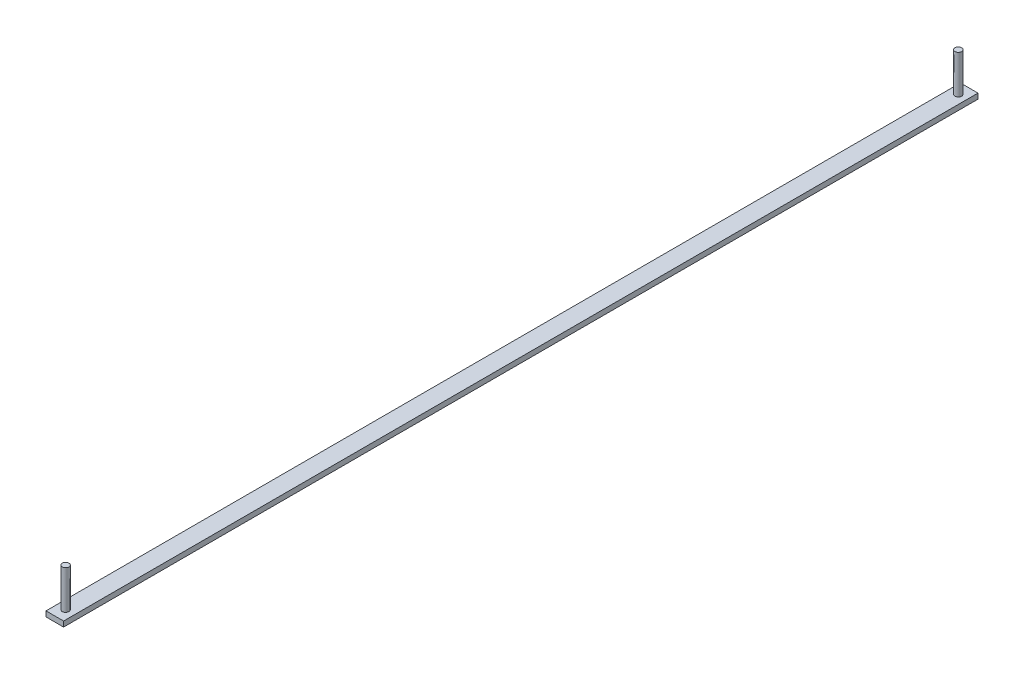
ISO-10303-21;
HEADER;
FILE_DESCRIPTION(('STEP AP214'),'2;1');
FILE_NAME('part.step','',(''),(''),'','','');
FILE_SCHEMA(('AUTOMOTIVE_DESIGN { 1 0 10303 214 1 1 1 1 }'));
ENDSEC;
DATA;
#1=APPLICATION_CONTEXT('core data for automotive mechanical design processes');
#2=APPLICATION_PROTOCOL_DEFINITION('international standard','automotive_design',2000,#1);
#3=PRODUCT_CONTEXT('',#1,'mechanical');
#4=PRODUCT('Part','Part','',(#3));
#5=PRODUCT_RELATED_PRODUCT_CATEGORY('part','',(#4));
#6=PRODUCT_DEFINITION_FORMATION('','',#4);
#7=PRODUCT_DEFINITION_CONTEXT('part definition',#1,'design');
#8=PRODUCT_DEFINITION('design','',#6,#7);
#9=PRODUCT_DEFINITION_SHAPE('','',#8);
#10=(LENGTH_UNIT() NAMED_UNIT(*) SI_UNIT(.MILLI.,.METRE.));
#11=(NAMED_UNIT(*) PLANE_ANGLE_UNIT() SI_UNIT($,.RADIAN.));
#12=(NAMED_UNIT(*) SI_UNIT($,.STERADIAN.) SOLID_ANGLE_UNIT());
#13=UNCERTAINTY_MEASURE_WITH_UNIT(LENGTH_MEASURE(1.E-05),#10,'distance_accuracy_value','');
#14=(GEOMETRIC_REPRESENTATION_CONTEXT(3) GLOBAL_UNCERTAINTY_ASSIGNED_CONTEXT((#13)) GLOBAL_UNIT_ASSIGNED_CONTEXT((#10,
#11,#12)) REPRESENTATION_CONTEXT('',''));
#15=CARTESIAN_POINT('',(0.,0.,0.));
#16=DIRECTION('',(0.,0.,1.));
#17=DIRECTION('',(1.,0.,0.));
#18=AXIS2_PLACEMENT_3D('',#15,#16,#17);
#19=CARTESIAN_POINT('',(0.,7.61999999999996,0.));
#20=DIRECTION('',(1.,0.,0.));
#21=DIRECTION('',(0.,0.,-1.));
#22=AXIS2_PLACEMENT_3D('',#19,#20,#21);
#23=PLANE('',#22);
#24=DIRECTION('',(0.,0.,1.));
#25=VECTOR('',#24,1.);
#26=CARTESIAN_POINT('',(0.,0.,0.));
#27=LINE('',#26,#25);
#28=CARTESIAN_POINT('',(-5.55111512312578E-13,1.33226762955019E-12,-1320.8));
#29=VERTEX_POINT('',#28);
#30=CARTESIAN_POINT('',(0.,0.,0.));
#31=VERTEX_POINT('',#30);
#32=EDGE_CURVE('E103',#29,#31,#27,.T.);
#33=ORIENTED_EDGE('',*,*,#32,.T.);
#34=DIRECTION('',(0.,-1.,0.));
#35=VECTOR('',#34,1.);
#36=CARTESIAN_POINT('',(0.,7.61999999999996,0.));
#37=LINE('',#36,#35);
#38=CARTESIAN_POINT('',(0.,7.61999999999996,0.));
#39=VERTEX_POINT('',#38);
#40=EDGE_CURVE('E94',#39,#31,#37,.T.);
#41=ORIENTED_EDGE('',*,*,#40,.F.);
#42=DIRECTION('',(0.,0.,1.));
#43=VECTOR('',#42,1.);
#44=CARTESIAN_POINT('',(0.,7.61999999999996,0.));
#45=LINE('',#44,#43);
#46=CARTESIAN_POINT('',(-5.55111512312578E-13,7.62000000000129,-1320.8));
#47=VERTEX_POINT('',#46);
#48=EDGE_CURVE('E88',#47,#39,#45,.T.);
#49=ORIENTED_EDGE('',*,*,#48,.F.);
#50=DIRECTION('',(0.,-1.,0.));
#51=VECTOR('',#50,1.);
#52=CARTESIAN_POINT('',(-5.55111512312578E-13,7.62000000000129,-1320.8));
#53=LINE('',#52,#51);
#54=EDGE_CURVE('E99',#47,#29,#53,.T.);
#55=ORIENTED_EDGE('',*,*,#54,.T.);
#56=EDGE_LOOP('',(#33,#41,#49,#55));
#57=FACE_BOUND('',#56,.T.);
#58=ADVANCED_FACE('F36',(#57),#23,.F.);
#59=CARTESIAN_POINT('',(0.,7.61999999999996,0.));
#60=DIRECTION('',(0.,0.,-1.));
#61=DIRECTION('',(-1.,0.,0.));
#62=AXIS2_PLACEMENT_3D('',#59,#60,#61);
#63=PLANE('',#62);
#64=DIRECTION('',(1.,0.,0.));
#65=VECTOR('',#64,1.);
#66=CARTESIAN_POINT('',(0.,0.,0.));
#67=LINE('',#66,#65);
#68=CARTESIAN_POINT('',(25.4,0.,0.));
#69=VERTEX_POINT('',#68);
#70=EDGE_CURVE('E93',#31,#69,#67,.T.);
#71=ORIENTED_EDGE('',*,*,#70,.T.);
#72=DIRECTION('',(0.,-1.,0.));
#73=VECTOR('',#72,1.);
#74=CARTESIAN_POINT('',(25.4,7.61999999999996,0.));
#75=LINE('',#74,#73);
#76=CARTESIAN_POINT('',(25.4,7.61999999999996,0.));
#77=VERTEX_POINT('',#76);
#78=EDGE_CURVE('E91',#77,#69,#75,.T.);
#79=ORIENTED_EDGE('',*,*,#78,.F.);
#80=DIRECTION('',(1.,0.,0.));
#81=VECTOR('',#80,1.);
#82=CARTESIAN_POINT('',(0.,7.61999999999996,0.));
#83=LINE('',#82,#81);
#84=EDGE_CURVE('E83',#39,#77,#83,.T.);
#85=ORIENTED_EDGE('',*,*,#84,.F.);
#86=ORIENTED_EDGE('',*,*,#40,.T.);
#87=EDGE_LOOP('',(#71,#79,#85,#86));
#88=FACE_BOUND('',#87,.T.);
#89=ADVANCED_FACE('F92',(#88),#63,.F.);
#90=CARTESIAN_POINT('',(25.4,7.61999999999996,0.));
#91=DIRECTION('',(-1.,0.,0.));
#92=DIRECTION('',(0.,0.,1.));
#93=AXIS2_PLACEMENT_3D('',#90,#91,#92);
#94=PLANE('',#93);
#95=DIRECTION('',(0.,0.,-1.));
#96=VECTOR('',#95,1.);
#97=CARTESIAN_POINT('',(25.4,0.,0.));
#98=LINE('',#97,#96);
#99=CARTESIAN_POINT('',(25.3999999999997,0.,-1320.8));
#100=VERTEX_POINT('',#99);
#101=EDGE_CURVE('E69',#69,#100,#98,.T.);
#102=ORIENTED_EDGE('',*,*,#101,.T.);
#103=DIRECTION('',(0.,-1.,0.));
#104=VECTOR('',#103,1.);
#105=CARTESIAN_POINT('',(25.3999999999997,7.62000000000018,-1320.8));
#106=LINE('',#105,#104);
#107=CARTESIAN_POINT('',(25.3999999999997,7.62000000000018,-1320.8));
#108=VERTEX_POINT('',#107);
#109=EDGE_CURVE('E95',#108,#100,#106,.T.);
#110=ORIENTED_EDGE('',*,*,#109,.F.);
#111=DIRECTION('',(0.,0.,-1.));
#112=VECTOR('',#111,1.);
#113=CARTESIAN_POINT('',(25.4,7.61999999999996,0.));
#114=LINE('',#113,#112);
#115=EDGE_CURVE('E86',#77,#108,#114,.T.);
#116=ORIENTED_EDGE('',*,*,#115,.F.);
#117=ORIENTED_EDGE('',*,*,#78,.T.);
#118=EDGE_LOOP('',(#102,#110,#116,#117));
#119=FACE_BOUND('',#118,.T.);
#120=ADVANCED_FACE('F97',(#119),#94,.F.);
#121=CARTESIAN_POINT('',(-5.55111512312578E-13,7.62000000000129,-1320.8));
#122=DIRECTION('',(0.,0.,1.));
#123=DIRECTION('',(1.,0.,0.));
#124=AXIS2_PLACEMENT_3D('',#121,#122,#123);
#125=PLANE('',#124);
#126=DIRECTION('',(-1.,0.,0.));
#127=VECTOR('',#126,1.);
#128=CARTESIAN_POINT('',(-5.55111512312578E-13,1.33226762955019E-12,-1320.8));
#129=LINE('',#128,#127);
#130=EDGE_CURVE('E75',#100,#29,#129,.T.);
#131=ORIENTED_EDGE('',*,*,#130,.T.);
#132=ORIENTED_EDGE('',*,*,#54,.F.);
#133=DIRECTION('',(-1.,0.,0.));
#134=VECTOR('',#133,1.);
#135=CARTESIAN_POINT('',(-5.55111512312578E-13,7.62000000000129,-1320.8));
#136=LINE('',#135,#134);
#137=EDGE_CURVE('E52',#108,#47,#136,.T.);
#138=ORIENTED_EDGE('',*,*,#137,.F.);
#139=ORIENTED_EDGE('',*,*,#109,.T.);
#140=EDGE_LOOP('',(#131,#132,#138,#139));
#141=FACE_BOUND('',#140,.T.);
#142=ADVANCED_FACE('F119',(#141),#125,.F.);
#143=CARTESIAN_POINT('',(0.,7.61999999999996,0.));
#144=DIRECTION('',(0.,-1.,0.));
#145=DIRECTION('',(0.,0.,-1.));
#146=AXIS2_PLACEMENT_3D('',#143,#144,#145);
#147=PLANE('',#146);
#148=CARTESIAN_POINT('',(12.7,7.61999999999885,-1305.052));
#149=DIRECTION('',(0.,-1.,0.));
#150=DIRECTION('',(0.,0.,-1.));
#151=AXIS2_PLACEMENT_3D('',#148,#149,#150);
#152=CIRCLE('',#151,4.82600000000005);
#153=CARTESIAN_POINT('',(12.7,7.61999999999885,-1309.878));
#154=VERTEX_POINT('',#153);
#155=EDGE_CURVE('E11',#154,#154,#152,.F.);
#156=ORIENTED_EDGE('',*,*,#155,.F.);
#157=EDGE_LOOP('',(#156));
#158=FACE_BOUND('',#157,.T.);
#159=CARTESIAN_POINT('',(12.7000000000001,7.61999999999996,-15.6209999999994));
#160=DIRECTION('',(0.,-1.,0.));
#161=DIRECTION('',(0.,0.,-1.));
#162=AXIS2_PLACEMENT_3D('',#159,#160,#161);
#163=CIRCLE('',#162,4.826);
#164=CARTESIAN_POINT('',(12.7000000000001,7.61999999999996,-20.4469999999994));
#165=VERTEX_POINT('',#164);
#166=EDGE_CURVE('E44',#165,#165,#163,.F.);
#167=ORIENTED_EDGE('',*,*,#166,.F.);
#168=EDGE_LOOP('',(#167));
#169=FACE_BOUND('',#168,.T.);
#170=ORIENTED_EDGE('',*,*,#48,.T.);
#171=ORIENTED_EDGE('',*,*,#84,.T.);
#172=ORIENTED_EDGE('',*,*,#115,.T.);
#173=ORIENTED_EDGE('',*,*,#137,.T.);
#174=EDGE_LOOP('',(#170,#171,#172,#173));
#175=FACE_BOUND('',#174,.T.);
#176=ADVANCED_FACE('F84',(#158,#169,#175),#147,.F.);
#177=CARTESIAN_POINT('',(0.,0.,0.));
#178=DIRECTION('',(0.,-1.,0.));
#179=DIRECTION('',(0.,0.,-1.));
#180=AXIS2_PLACEMENT_3D('',#177,#178,#179);
#181=PLANE('',#180);
#182=ORIENTED_EDGE('',*,*,#32,.F.);
#183=ORIENTED_EDGE('',*,*,#130,.F.);
#184=ORIENTED_EDGE('',*,*,#101,.F.);
#185=ORIENTED_EDGE('',*,*,#70,.F.);
#186=EDGE_LOOP('',(#182,#183,#184,#185));
#187=FACE_BOUND('',#186,.T.);
#188=ADVANCED_FACE('F118',(#187),#181,.T.);
#189=CARTESIAN_POINT('',(12.6999999999998,63.4999999999999,-15.6209999999994));
#190=DIRECTION('',(0.,-1.,0.));
#191=DIRECTION('',(0.,0.,-1.));
#192=AXIS2_PLACEMENT_3D('',#189,#190,#191);
#193=CYLINDRICAL_SURFACE('',#192,4.826);
#194=CARTESIAN_POINT('',(12.6999999999998,63.4999999999999,-15.6209999999994));
#195=DIRECTION('',(0.,1.,0.));
#196=DIRECTION('',(0.,0.,1.));
#197=AXIS2_PLACEMENT_3D('',#194,#195,#196);
#198=CIRCLE('',#197,4.826);
#199=CARTESIAN_POINT('',(12.6999999999998,63.4999999999999,-10.7949999999994));
#200=VERTEX_POINT('',#199);
#201=EDGE_CURVE('E106',#200,#200,#198,.T.);
#202=ORIENTED_EDGE('',*,*,#201,.F.);
#203=EDGE_LOOP('',(#202));
#204=FACE_BOUND('',#203,.T.);
#205=ORIENTED_EDGE('',*,*,#166,.T.);
#206=EDGE_LOOP('',(#205));
#207=FACE_BOUND('',#206,.T.);
#208=ADVANCED_FACE('F115',(#204,#207),#193,.T.);
#209=CARTESIAN_POINT('',(12.6999999999998,63.4999999999999,-15.6209999999994));
#210=DIRECTION('',(0.,1.,0.));
#211=DIRECTION('',(0.,0.,1.));
#212=AXIS2_PLACEMENT_3D('',#209,#210,#211);
#213=PLANE('',#212);
#214=ORIENTED_EDGE('',*,*,#201,.T.);
#215=EDGE_LOOP('',(#214));
#216=FACE_BOUND('',#215,.T.);
#217=ADVANCED_FACE('F149',(#216),#213,.T.);
#218=CARTESIAN_POINT('',(12.6999999999997,63.4999999999994,-1305.052));
#219=DIRECTION('',(0.,-1.,0.));
#220=DIRECTION('',(0.,0.,-1.));
#221=AXIS2_PLACEMENT_3D('',#218,#219,#220);
#222=CYLINDRICAL_SURFACE('',#221,4.82600000000005);
#223=CARTESIAN_POINT('',(12.6999999999997,63.4999999999994,-1305.052));
#224=DIRECTION('',(0.,1.,0.));
#225=DIRECTION('',(0.,0.,1.));
#226=AXIS2_PLACEMENT_3D('',#223,#224,#225);
#227=CIRCLE('',#226,4.82600000000005);
#228=CARTESIAN_POINT('',(12.6999999999997,63.4999999999994,-1300.226));
#229=VERTEX_POINT('',#228);
#230=EDGE_CURVE('E140',#229,#229,#227,.T.);
#231=ORIENTED_EDGE('',*,*,#230,.F.);
#232=EDGE_LOOP('',(#231));
#233=FACE_BOUND('',#232,.T.);
#234=ORIENTED_EDGE('',*,*,#155,.T.);
#235=EDGE_LOOP('',(#234));
#236=FACE_BOUND('',#235,.T.);
#237=ADVANCED_FACE('F146',(#233,#236),#222,.T.);
#238=CARTESIAN_POINT('',(12.6999999999997,63.4999999999994,-1305.052));
#239=DIRECTION('',(0.,1.,0.));
#240=DIRECTION('',(0.,0.,1.));
#241=AXIS2_PLACEMENT_3D('',#238,#239,#240);
#242=PLANE('',#241);
#243=ORIENTED_EDGE('',*,*,#230,.T.);
#244=EDGE_LOOP('',(#243));
#245=FACE_BOUND('',#244,.T.);
#246=ADVANCED_FACE('F144',(#245),#242,.T.);
#247=CLOSED_SHELL('',(#58,#89,#120,#142,#176,#188,#208,#217,#237,#246));
#248=MANIFOLD_SOLID_BREP('B2',#247);
#249=ADVANCED_BREP_SHAPE_REPRESENTATION('',(#18,#248),#14);
#250=SHAPE_DEFINITION_REPRESENTATION(#9,#249);
ENDSEC;
END-ISO-10303-21;
